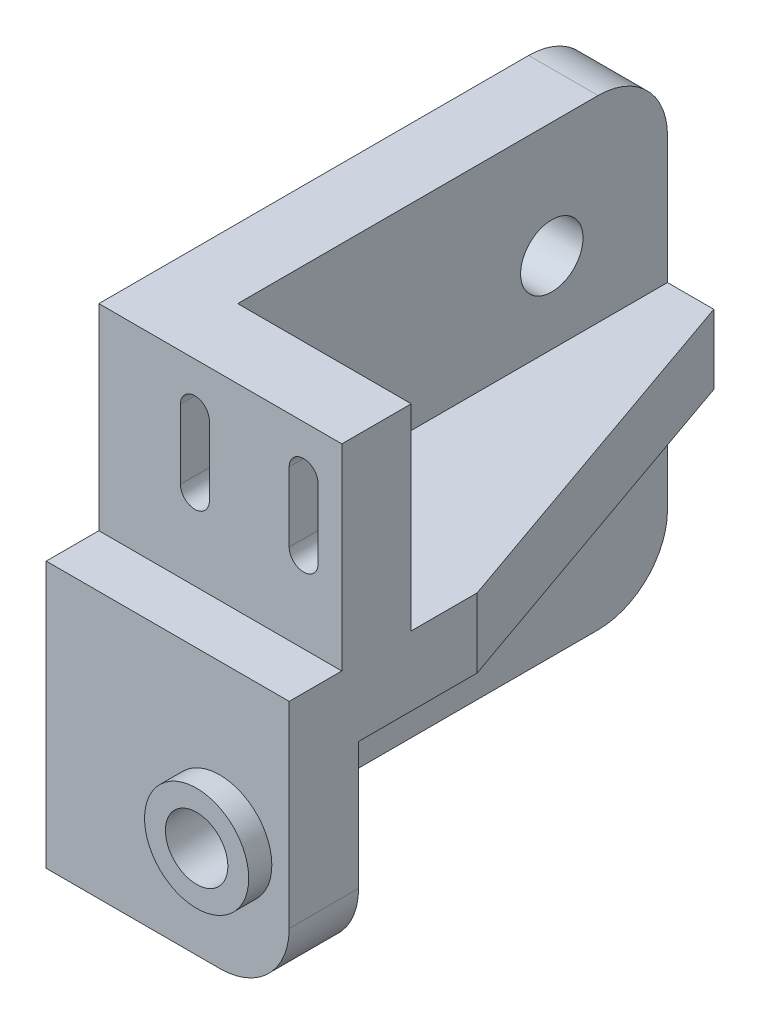
ISO-10303-21;
HEADER;
FILE_DESCRIPTION(('STEP AP214'),'2;1');
FILE_NAME('part.step','',(''),(''),'','','');
FILE_SCHEMA(('AUTOMOTIVE_DESIGN { 1 0 10303 214 1 1 1 1 }'));
ENDSEC;
DATA;
#1=APPLICATION_CONTEXT('core data for automotive mechanical design processes');
#2=APPLICATION_PROTOCOL_DEFINITION('international standard','automotive_design',2000,#1);
#3=PRODUCT_CONTEXT('',#1,'mechanical');
#4=PRODUCT('Part','Part','',(#3));
#5=PRODUCT_RELATED_PRODUCT_CATEGORY('part','',(#4));
#6=PRODUCT_DEFINITION_FORMATION('','',#4);
#7=PRODUCT_DEFINITION_CONTEXT('part definition',#1,'design');
#8=PRODUCT_DEFINITION('design','',#6,#7);
#9=PRODUCT_DEFINITION_SHAPE('','',#8);
#10=(LENGTH_UNIT() NAMED_UNIT(*) SI_UNIT(.MILLI.,.METRE.));
#11=(NAMED_UNIT(*) PLANE_ANGLE_UNIT() SI_UNIT($,.RADIAN.));
#12=(NAMED_UNIT(*) SI_UNIT($,.STERADIAN.) SOLID_ANGLE_UNIT());
#13=UNCERTAINTY_MEASURE_WITH_UNIT(LENGTH_MEASURE(1.E-05),#10,'distance_accuracy_value','');
#14=(GEOMETRIC_REPRESENTATION_CONTEXT(3) GLOBAL_UNCERTAINTY_ASSIGNED_CONTEXT((#13)) GLOBAL_UNIT_ASSIGNED_CONTEXT((#10,
#11,#12)) REPRESENTATION_CONTEXT('',''));
#15=CARTESIAN_POINT('',(0.,0.,0.));
#16=DIRECTION('',(0.,0.,1.));
#17=DIRECTION('',(1.,0.,0.));
#18=AXIS2_PLACEMENT_3D('',#15,#16,#17);
#19=CARTESIAN_POINT('',(6.,0.,0.));
#20=DIRECTION('',(0.,0.,1.));
#21=DIRECTION('',(1.,0.,0.));
#22=AXIS2_PLACEMENT_3D('',#19,#20,#21);
#23=PLANE('',#22);
#24=CARTESIAN_POINT('',(17.7,36.,0.));
#25=DIRECTION('',(0.,0.,1.));
#26=DIRECTION('',(1.,0.,0.));
#27=AXIS2_PLACEMENT_3D('',#24,#25,#26);
#28=CIRCLE('',#27,1.25);
#29=CARTESIAN_POINT('',(18.95,36.,0.));
#30=VERTEX_POINT('',#29);
#31=CARTESIAN_POINT('',(16.45,36.,0.));
#32=VERTEX_POINT('',#31);
#33=EDGE_CURVE('E228',#30,#32,#28,.T.);
#34=ORIENTED_EDGE('',*,*,#33,.F.);
#35=DIRECTION('',(0.,1.,0.));
#36=VECTOR('',#35,1.);
#37=CARTESIAN_POINT('',(18.95,36.,0.));
#38=LINE('',#37,#36);
#39=CARTESIAN_POINT('',(18.95,30.,0.));
#40=VERTEX_POINT('',#39);
#41=EDGE_CURVE('E232',#40,#30,#38,.T.);
#42=ORIENTED_EDGE('',*,*,#41,.F.);
#43=CARTESIAN_POINT('',(17.7,30.,0.));
#44=DIRECTION('',(0.,0.,1.));
#45=DIRECTION('',(1.,0.,0.));
#46=AXIS2_PLACEMENT_3D('',#43,#44,#45);
#47=CIRCLE('',#46,1.25);
#48=CARTESIAN_POINT('',(16.45,30.,0.));
#49=VERTEX_POINT('',#48);
#50=EDGE_CURVE('E210',#49,#40,#47,.T.);
#51=ORIENTED_EDGE('',*,*,#50,.F.);
#52=DIRECTION('',(0.,-1.,0.));
#53=VECTOR('',#52,1.);
#54=CARTESIAN_POINT('',(16.45,36.,0.));
#55=LINE('',#54,#53);
#56=EDGE_CURVE('E222',#32,#49,#55,.T.);
#57=ORIENTED_EDGE('',*,*,#56,.F.);
#58=EDGE_LOOP('',(#34,#42,#51,#57));
#59=FACE_BOUND('',#58,.T.);
#60=CARTESIAN_POINT('',(8.3,35.9999999999999,0.));
#61=DIRECTION('',(0.,0.,1.));
#62=DIRECTION('',(1.,0.,0.));
#63=AXIS2_PLACEMENT_3D('',#60,#61,#62);
#64=CIRCLE('',#63,1.25);
#65=CARTESIAN_POINT('',(9.55,35.9999999999999,0.));
#66=VERTEX_POINT('',#65);
#67=CARTESIAN_POINT('',(7.05,35.9999999999999,0.));
#68=VERTEX_POINT('',#67);
#69=EDGE_CURVE('E247',#66,#68,#64,.T.);
#70=ORIENTED_EDGE('',*,*,#69,.F.);
#71=DIRECTION('',(0.,1.,0.));
#72=VECTOR('',#71,1.);
#73=CARTESIAN_POINT('',(9.55,35.9999999999999,0.));
#74=LINE('',#73,#72);
#75=CARTESIAN_POINT('',(9.55,29.9999999999999,0.));
#76=VERTEX_POINT('',#75);
#77=EDGE_CURVE('E258',#76,#66,#74,.T.);
#78=ORIENTED_EDGE('',*,*,#77,.F.);
#79=CARTESIAN_POINT('',(8.3,29.9999999999999,0.));
#80=DIRECTION('',(0.,0.,1.));
#81=DIRECTION('',(1.,0.,0.));
#82=AXIS2_PLACEMENT_3D('',#79,#80,#81);
#83=CIRCLE('',#82,1.25);
#84=CARTESIAN_POINT('',(7.05,29.9999999999999,0.));
#85=VERTEX_POINT('',#84);
#86=EDGE_CURVE('E254',#85,#76,#83,.T.);
#87=ORIENTED_EDGE('',*,*,#86,.F.);
#88=DIRECTION('',(0.,-1.,0.));
#89=VECTOR('',#88,1.);
#90=CARTESIAN_POINT('',(7.05,35.9999999999999,0.));
#91=LINE('',#90,#89);
#92=EDGE_CURVE('E250',#68,#85,#91,.T.);
#93=ORIENTED_EDGE('',*,*,#92,.F.);
#94=EDGE_LOOP('',(#70,#78,#87,#93));
#95=FACE_BOUND('',#94,.T.);
#96=DIRECTION('',(0.,1.,0.));
#97=VECTOR('',#96,1.);
#98=CARTESIAN_POINT('',(0.,0.,0.));
#99=LINE('',#98,#97);
#100=CARTESIAN_POINT('',(0.,23.,0.));
#101=VERTEX_POINT('',#100);
#102=CARTESIAN_POINT('',(0.,40.,0.));
#103=VERTEX_POINT('',#102);
#104=EDGE_CURVE('E387',#101,#103,#99,.T.);
#105=ORIENTED_EDGE('',*,*,#104,.F.);
#106=DIRECTION('',(-1.,0.,0.));
#107=VECTOR('',#106,1.);
#108=CARTESIAN_POINT('',(21.,23.,0.));
#109=LINE('',#108,#107);
#110=CARTESIAN_POINT('',(21.,23.,0.));
#111=VERTEX_POINT('',#110);
#112=EDGE_CURVE('E346',#111,#101,#109,.T.);
#113=ORIENTED_EDGE('',*,*,#112,.F.);
#114=DIRECTION('',(0.,-1.,0.));
#115=VECTOR('',#114,1.);
#116=CARTESIAN_POINT('',(21.,40.,0.));
#117=LINE('',#116,#115);
#118=CARTESIAN_POINT('',(21.,40.,0.));
#119=VERTEX_POINT('',#118);
#120=EDGE_CURVE('E331',#119,#111,#117,.T.);
#121=ORIENTED_EDGE('',*,*,#120,.F.);
#122=DIRECTION('',(-1.,0.,0.));
#123=VECTOR('',#122,1.);
#124=CARTESIAN_POINT('',(6.,40.,0.));
#125=LINE('',#124,#123);
#126=EDGE_CURVE('E400',#119,#103,#125,.T.);
#127=ORIENTED_EDGE('',*,*,#126,.T.);
#128=EDGE_LOOP('',(#105,#113,#121,#127));
#129=FACE_BOUND('',#128,.T.);
#130=ADVANCED_FACE('F41',(#59,#95,#129),#23,.T.);
#131=CARTESIAN_POINT('',(6.,0.,0.));
#132=DIRECTION('',(-1.,0.,0.));
#133=DIRECTION('',(0.,0.,1.));
#134=AXIS2_PLACEMENT_3D('',#131,#132,#133);
#135=PLANE('',#134);
#136=CARTESIAN_POINT('',(6.,10.,-33.15));
#137=DIRECTION('',(-1.,0.,0.));
#138=DIRECTION('',(0.,0.,1.));
#139=AXIS2_PLACEMENT_3D('',#136,#137,#138);
#140=CIRCLE('',#139,2.7);
#141=CARTESIAN_POINT('',(6.,10.,-30.45));
#142=VERTEX_POINT('',#141);
#143=EDGE_CURVE('E304',#142,#142,#140,.T.);
#144=ORIENTED_EDGE('',*,*,#143,.T.);
#145=EDGE_LOOP('',(#144));
#146=FACE_BOUND('',#145,.T.);
#147=DIRECTION('',(0.,0.,-1.));
#148=VECTOR('',#147,1.);
#149=CARTESIAN_POINT('',(6.,0.,0.));
#150=LINE('',#149,#148);
#151=CARTESIAN_POINT('',(6.,0.,-1.45));
#152=VERTEX_POINT('',#151);
#153=CARTESIAN_POINT('',(6.,0.,-37.15));
#154=VERTEX_POINT('',#153);
#155=EDGE_CURVE('E397',#152,#154,#150,.T.);
#156=ORIENTED_EDGE('',*,*,#155,.T.);
#157=CARTESIAN_POINT('',(6.,6.,-37.15));
#158=DIRECTION('',(-1.,0.,0.));
#159=DIRECTION('',(0.,0.,1.));
#160=AXIS2_PLACEMENT_3D('',#157,#158,#159);
#161=CIRCLE('',#160,6.);
#162=CARTESIAN_POINT('',(6.,6.,-43.15));
#163=VERTEX_POINT('',#162);
#164=EDGE_CURVE('E11',#154,#163,#161,.F.);
#165=ORIENTED_EDGE('',*,*,#164,.T.);
#166=DIRECTION('',(0.,1.,0.));
#167=VECTOR('',#166,1.);
#168=CARTESIAN_POINT('',(6.,0.,-43.15));
#169=LINE('',#168,#167);
#170=CARTESIAN_POINT('',(6.,17.,-43.15));
#171=VERTEX_POINT('',#170);
#172=EDGE_CURVE('E394',#163,#171,#169,.T.);
#173=ORIENTED_EDGE('',*,*,#172,.T.);
#174=DIRECTION('',(0.,0.,-1.));
#175=VECTOR('',#174,1.);
#176=CARTESIAN_POINT('',(6.,17.,0.));
#177=LINE('',#176,#175);
#178=CARTESIAN_POINT('',(6.,17.,-1.45));
#179=VERTEX_POINT('',#178);
#180=EDGE_CURVE('E380',#179,#171,#177,.T.);
#181=ORIENTED_EDGE('',*,*,#180,.F.);
#182=DIRECTION('',(0.,1.,0.));
#183=VECTOR('',#182,1.);
#184=CARTESIAN_POINT('',(6.,0.,-1.45));
#185=LINE('',#184,#183);
#186=EDGE_CURVE('E384',#152,#179,#185,.T.);
#187=ORIENTED_EDGE('',*,*,#186,.F.);
#188=EDGE_LOOP('',(#156,#165,#173,#181,#187));
#189=FACE_BOUND('',#188,.T.);
#190=ADVANCED_FACE('F539',(#146,#189),#135,.F.);
#191=CARTESIAN_POINT('',(6.,30.,-33.15));
#192=DIRECTION('',(-1.,0.,0.));
#193=DIRECTION('',(0.,0.,1.));
#194=AXIS2_PLACEMENT_3D('',#191,#192,#193);
#195=CIRCLE('',#194,2.69999999999999);
#196=CARTESIAN_POINT('',(6.,30.,-30.45));
#197=VERTEX_POINT('',#196);
#198=EDGE_CURVE('E296',#197,#197,#195,.T.);
#199=ORIENTED_EDGE('',*,*,#198,.T.);
#200=EDGE_LOOP('',(#199));
#201=FACE_BOUND('',#200,.T.);
#202=CARTESIAN_POINT('',(6.,23.,-43.15));
#203=VERTEX_POINT('',#202);
#204=CARTESIAN_POINT('',(6.,34.,-43.15));
#205=VERTEX_POINT('',#204);
#206=EDGE_CURVE('E392',#203,#205,#169,.T.);
#207=ORIENTED_EDGE('',*,*,#206,.T.);
#208=CARTESIAN_POINT('',(6.,34.,-37.15));
#209=DIRECTION('',(-1.,0.,0.));
#210=DIRECTION('',(0.,0.,1.));
#211=AXIS2_PLACEMENT_3D('',#208,#209,#210);
#212=CIRCLE('',#211,6.);
#213=CARTESIAN_POINT('',(6.,40.,-37.15));
#214=VERTEX_POINT('',#213);
#215=EDGE_CURVE('E484',#205,#214,#212,.F.);
#216=ORIENTED_EDGE('',*,*,#215,.T.);
#217=DIRECTION('',(0.,0.,-1.));
#218=VECTOR('',#217,1.);
#219=CARTESIAN_POINT('',(6.,40.,0.));
#220=LINE('',#219,#218);
#221=CARTESIAN_POINT('',(6.,40.,-6.));
#222=VERTEX_POINT('',#221);
#223=EDGE_CURVE('E388',#222,#214,#220,.T.);
#224=ORIENTED_EDGE('',*,*,#223,.F.);
#225=DIRECTION('',(0.,1.,0.));
#226=VECTOR('',#225,1.);
#227=CARTESIAN_POINT('',(6.,0.,-6.));
#228=LINE('',#227,#226);
#229=CARTESIAN_POINT('',(6.,23.,-6.));
#230=VERTEX_POINT('',#229);
#231=EDGE_CURVE('E374',#230,#222,#228,.T.);
#232=ORIENTED_EDGE('',*,*,#231,.F.);
#233=DIRECTION('',(0.,0.,1.));
#234=VECTOR('',#233,1.);
#235=CARTESIAN_POINT('',(6.,23.,0.));
#236=LINE('',#235,#234);
#237=EDGE_CURVE('E377',#203,#230,#236,.T.);
#238=ORIENTED_EDGE('',*,*,#237,.F.);
#239=EDGE_LOOP('',(#207,#216,#224,#232,#238));
#240=FACE_BOUND('',#239,.T.);
#241=ADVANCED_FACE('F491',(#201,#240),#135,.F.);
#242=CARTESIAN_POINT('',(6.,0.,0.));
#243=DIRECTION('',(0.,1.,0.));
#244=DIRECTION('',(0.,0.,1.));
#245=AXIS2_PLACEMENT_3D('',#242,#243,#244);
#246=PLANE('',#245);
#247=DIRECTION('',(0.,0.,-1.));
#248=VECTOR('',#247,1.);
#249=CARTESIAN_POINT('',(0.,0.,0.));
#250=LINE('',#249,#248);
#251=CARTESIAN_POINT('',(0.,0.,4.55));
#252=VERTEX_POINT('',#251);
#253=CARTESIAN_POINT('',(0.,0.,-37.15));
#254=VERTEX_POINT('',#253);
#255=EDGE_CURVE('E393',#252,#254,#250,.T.);
#256=ORIENTED_EDGE('',*,*,#255,.T.);
#257=DIRECTION('',(-1.,0.,0.));
#258=VECTOR('',#257,1.);
#259=CARTESIAN_POINT('',(6.,0.,-37.15));
#260=LINE('',#259,#258);
#261=EDGE_CURVE('E50',#254,#154,#260,.F.);
#262=ORIENTED_EDGE('',*,*,#261,.T.);
#263=ORIENTED_EDGE('',*,*,#155,.F.);
#264=DIRECTION('',(-1.,0.,0.));
#265=VECTOR('',#264,1.);
#266=CARTESIAN_POINT('',(21.,0.,-1.45));
#267=LINE('',#266,#265);
#268=CARTESIAN_POINT('',(15.,0.,-1.45));
#269=VERTEX_POINT('',#268);
#270=EDGE_CURVE('E368',#269,#152,#267,.T.);
#271=ORIENTED_EDGE('',*,*,#270,.F.);
#272=DIRECTION('',(0.,0.,-1.));
#273=VECTOR('',#272,1.);
#274=CARTESIAN_POINT('',(15.,0.,4.55));
#275=LINE('',#274,#273);
#276=CARTESIAN_POINT('',(15.,0.,4.55));
#277=VERTEX_POINT('',#276);
#278=EDGE_CURVE('E462',#269,#277,#275,.F.);
#279=ORIENTED_EDGE('',*,*,#278,.T.);
#280=DIRECTION('',(-1.,0.,0.));
#281=VECTOR('',#280,1.);
#282=CARTESIAN_POINT('',(21.,0.,4.55));
#283=LINE('',#282,#281);
#284=EDGE_CURVE('E371',#277,#252,#283,.T.);
#285=ORIENTED_EDGE('',*,*,#284,.T.);
#286=EDGE_LOOP('',(#256,#262,#263,#271,#279,#285));
#287=FACE_BOUND('',#286,.T.);
#288=ADVANCED_FACE('F545',(#287),#246,.F.);
#289=CARTESIAN_POINT('',(6.,0.,-43.15));
#290=DIRECTION('',(0.,0.,1.));
#291=DIRECTION('',(1.,0.,0.));
#292=AXIS2_PLACEMENT_3D('',#289,#290,#291);
#293=PLANE('',#292);
#294=DIRECTION('',(0.,1.,0.));
#295=VECTOR('',#294,1.);
#296=CARTESIAN_POINT('',(0.,0.,-43.15));
#297=LINE('',#296,#295);
#298=CARTESIAN_POINT('',(0.,6.,-43.15));
#299=VERTEX_POINT('',#298);
#300=CARTESIAN_POINT('',(0.,34.,-43.15));
#301=VERTEX_POINT('',#300);
#302=EDGE_CURVE('E407',#299,#301,#297,.T.);
#303=ORIENTED_EDGE('',*,*,#302,.T.);
#304=DIRECTION('',(-1.,0.,0.));
#305=VECTOR('',#304,1.);
#306=CARTESIAN_POINT('',(6.,34.,-43.15));
#307=LINE('',#306,#305);
#308=EDGE_CURVE('E64',#301,#205,#307,.F.);
#309=ORIENTED_EDGE('',*,*,#308,.T.);
#310=ORIENTED_EDGE('',*,*,#206,.F.);
#311=DIRECTION('',(-1.,0.,0.));
#312=VECTOR('',#311,1.);
#313=CARTESIAN_POINT('',(21.,23.,-43.15));
#314=LINE('',#313,#312);
#315=CARTESIAN_POINT('',(9.99999999999999,23.,-43.15));
#316=VERTEX_POINT('',#315);
#317=EDGE_CURVE('E357',#316,#203,#314,.T.);
#318=ORIENTED_EDGE('',*,*,#317,.F.);
#319=DIRECTION('',(0.,-1.,0.));
#320=VECTOR('',#319,1.);
#321=CARTESIAN_POINT('',(9.99999999999999,17.,-43.15));
#322=LINE('',#321,#320);
#323=CARTESIAN_POINT('',(9.99999999999999,17.,-43.15));
#324=VERTEX_POINT('',#323);
#325=EDGE_CURVE('E422',#316,#324,#322,.T.);
#326=ORIENTED_EDGE('',*,*,#325,.T.);
#327=DIRECTION('',(-1.,0.,0.));
#328=VECTOR('',#327,1.);
#329=CARTESIAN_POINT('',(21.,17.,-43.15));
#330=LINE('',#329,#328);
#331=EDGE_CURVE('E360',#324,#171,#330,.T.);
#332=ORIENTED_EDGE('',*,*,#331,.T.);
#333=ORIENTED_EDGE('',*,*,#172,.F.);
#334=DIRECTION('',(-1.,0.,0.));
#335=VECTOR('',#334,1.);
#336=CARTESIAN_POINT('',(6.,6.,-43.15));
#337=LINE('',#336,#335);
#338=EDGE_CURVE('E478',#163,#299,#337,.T.);
#339=ORIENTED_EDGE('',*,*,#338,.T.);
#340=EDGE_LOOP('',(#303,#309,#310,#318,#326,#332,#333,#339));
#341=FACE_BOUND('',#340,.T.);
#342=ADVANCED_FACE('F522',(#341),#293,.F.);
#343=CARTESIAN_POINT('',(6.,40.,0.));
#344=DIRECTION('',(0.,1.,0.));
#345=DIRECTION('',(0.,0.,1.));
#346=AXIS2_PLACEMENT_3D('',#343,#344,#345);
#347=PLANE('',#346);
#348=ORIENTED_EDGE('',*,*,#223,.T.);
#349=DIRECTION('',(-1.,0.,0.));
#350=VECTOR('',#349,1.);
#351=CARTESIAN_POINT('',(0.,40.,-37.15));
#352=LINE('',#351,#350);
#353=CARTESIAN_POINT('',(0.,40.,-37.15));
#354=VERTEX_POINT('',#353);
#355=EDGE_CURVE('E468',#214,#354,#352,.T.);
#356=ORIENTED_EDGE('',*,*,#355,.T.);
#357=DIRECTION('',(0.,0.,-1.));
#358=VECTOR('',#357,1.);
#359=CARTESIAN_POINT('',(0.,40.,0.));
#360=LINE('',#359,#358);
#361=EDGE_CURVE('E403',#103,#354,#360,.T.);
#362=ORIENTED_EDGE('',*,*,#361,.F.);
#363=ORIENTED_EDGE('',*,*,#126,.F.);
#364=DIRECTION('',(0.,0.,1.));
#365=VECTOR('',#364,1.);
#366=CARTESIAN_POINT('',(21.,40.,0.));
#367=LINE('',#366,#365);
#368=CARTESIAN_POINT('',(21.,40.,-6.));
#369=VERTEX_POINT('',#368);
#370=EDGE_CURVE('E327',#369,#119,#367,.T.);
#371=ORIENTED_EDGE('',*,*,#370,.F.);
#372=DIRECTION('',(-1.,0.,0.));
#373=VECTOR('',#372,1.);
#374=CARTESIAN_POINT('',(21.,40.,-6.));
#375=LINE('',#374,#373);
#376=EDGE_CURVE('E349',#369,#222,#375,.T.);
#377=ORIENTED_EDGE('',*,*,#376,.T.);
#378=EDGE_LOOP('',(#348,#356,#362,#363,#371,#377));
#379=FACE_BOUND('',#378,.T.);
#380=ADVANCED_FACE('F500',(#379),#347,.T.);
#381=CARTESIAN_POINT('',(0.,0.,0.));
#382=DIRECTION('',(-1.,0.,0.));
#383=DIRECTION('',(0.,0.,1.));
#384=AXIS2_PLACEMENT_3D('',#381,#382,#383);
#385=PLANE('',#384);
#386=CARTESIAN_POINT('',(0.,30.,-33.15));
#387=DIRECTION('',(-1.,0.,0.));
#388=DIRECTION('',(0.,0.,1.));
#389=AXIS2_PLACEMENT_3D('',#386,#387,#388);
#390=CIRCLE('',#389,2.69999999999999);
#391=CARTESIAN_POINT('',(0.,30.,-30.45));
#392=VERTEX_POINT('',#391);
#393=EDGE_CURVE('E286',#392,#392,#390,.T.);
#394=ORIENTED_EDGE('',*,*,#393,.F.);
#395=EDGE_LOOP('',(#394));
#396=FACE_BOUND('',#395,.T.);
#397=CARTESIAN_POINT('',(0.,10.,-33.15));
#398=DIRECTION('',(-1.,0.,0.));
#399=DIRECTION('',(0.,0.,1.));
#400=AXIS2_PLACEMENT_3D('',#397,#398,#399);
#401=CIRCLE('',#400,2.7);
#402=CARTESIAN_POINT('',(0.,10.,-30.45));
#403=VERTEX_POINT('',#402);
#404=EDGE_CURVE('E300',#403,#403,#401,.T.);
#405=ORIENTED_EDGE('',*,*,#404,.F.);
#406=EDGE_LOOP('',(#405));
#407=FACE_BOUND('',#406,.T.);
#408=ORIENTED_EDGE('',*,*,#361,.T.);
#409=CARTESIAN_POINT('',(0.,34.,-37.15));
#410=DIRECTION('',(-1.,0.,0.));
#411=DIRECTION('',(0.,0.,1.));
#412=AXIS2_PLACEMENT_3D('',#409,#410,#411);
#413=CIRCLE('',#412,6.);
#414=EDGE_CURVE('E475',#354,#301,#413,.T.);
#415=ORIENTED_EDGE('',*,*,#414,.T.);
#416=ORIENTED_EDGE('',*,*,#302,.F.);
#417=CARTESIAN_POINT('',(0.,6.,-37.15));
#418=DIRECTION('',(-1.,0.,0.));
#419=DIRECTION('',(0.,0.,1.));
#420=AXIS2_PLACEMENT_3D('',#417,#418,#419);
#421=CIRCLE('',#420,6.);
#422=EDGE_CURVE('E472',#299,#254,#421,.T.);
#423=ORIENTED_EDGE('',*,*,#422,.T.);
#424=ORIENTED_EDGE('',*,*,#255,.F.);
#425=DIRECTION('',(0.,-1.,0.));
#426=VECTOR('',#425,1.);
#427=CARTESIAN_POINT('',(0.,23.,4.55));
#428=LINE('',#427,#426);
#429=CARTESIAN_POINT('',(0.,23.,4.55));
#430=VERTEX_POINT('',#429);
#431=EDGE_CURVE('E308',#430,#252,#428,.T.);
#432=ORIENTED_EDGE('',*,*,#431,.F.);
#433=DIRECTION('',(0.,0.,1.));
#434=VECTOR('',#433,1.);
#435=CARTESIAN_POINT('',(0.,23.,4.55));
#436=LINE('',#435,#434);
#437=EDGE_CURVE('E314',#101,#430,#436,.T.);
#438=ORIENTED_EDGE('',*,*,#437,.F.);
#439=ORIENTED_EDGE('',*,*,#104,.T.);
#440=EDGE_LOOP('',(#408,#415,#416,#423,#424,#432,#438,#439));
#441=FACE_BOUND('',#440,.T.);
#442=ADVANCED_FACE('F502',(#396,#407,#441),#385,.T.);
#443=CARTESIAN_POINT('',(21.,17.,-1.45));
#444=DIRECTION('',(0.,0.,1.));
#445=DIRECTION('',(0.,-1.,0.));
#446=AXIS2_PLACEMENT_3D('',#443,#444,#445);
#447=PLANE('',#446);
#448=CARTESIAN_POINT('',(15.,10.,-1.45));
#449=DIRECTION('',(0.,0.,1.));
#450=DIRECTION('',(0.,-1.,0.));
#451=AXIS2_PLACEMENT_3D('',#448,#449,#450);
#452=CIRCLE('',#451,2.69999999999999);
#453=CARTESIAN_POINT('',(15.,7.30000000000001,-1.45));
#454=VERTEX_POINT('',#453);
#455=EDGE_CURVE('E278',#454,#454,#452,.T.);
#456=ORIENTED_EDGE('',*,*,#455,.T.);
#457=EDGE_LOOP('',(#456));
#458=FACE_BOUND('',#457,.T.);
#459=DIRECTION('',(0.,1.,0.));
#460=VECTOR('',#459,1.);
#461=CARTESIAN_POINT('',(21.,17.,-1.45));
#462=LINE('',#461,#460);
#463=CARTESIAN_POINT('',(21.,6.,-1.45));
#464=VERTEX_POINT('',#463);
#465=CARTESIAN_POINT('',(21.,17.,-1.45));
#466=VERTEX_POINT('',#465);
#467=EDGE_CURVE('E313',#464,#466,#462,.T.);
#468=ORIENTED_EDGE('',*,*,#467,.F.);
#469=CARTESIAN_POINT('',(15.,6.,-1.45));
#470=DIRECTION('',(0.,0.,1.));
#471=DIRECTION('',(0.,-1.,0.));
#472=AXIS2_PLACEMENT_3D('',#469,#470,#471);
#473=CIRCLE('',#472,6.);
#474=EDGE_CURVE('E459',#464,#269,#473,.F.);
#475=ORIENTED_EDGE('',*,*,#474,.T.);
#476=ORIENTED_EDGE('',*,*,#270,.T.);
#477=ORIENTED_EDGE('',*,*,#186,.T.);
#478=DIRECTION('',(-1.,0.,0.));
#479=VECTOR('',#478,1.);
#480=CARTESIAN_POINT('',(21.,17.,-1.45));
#481=LINE('',#480,#479);
#482=EDGE_CURVE('E364',#466,#179,#481,.T.);
#483=ORIENTED_EDGE('',*,*,#482,.F.);
#484=EDGE_LOOP('',(#468,#475,#476,#477,#483));
#485=FACE_BOUND('',#484,.T.);
#486=ADVANCED_FACE('F535',(#458,#485),#447,.F.);
#487=CARTESIAN_POINT('',(21.,17.,-1.45));
#488=DIRECTION('',(0.,1.,0.));
#489=DIRECTION('',(0.,0.,1.));
#490=AXIS2_PLACEMENT_3D('',#487,#488,#489);
#491=PLANE('',#490);
#492=ORIENTED_EDGE('',*,*,#331,.F.);
#493=DIRECTION('',(0.330149880798441,0.,0.943928522828278));
#494=VECTOR('',#493,1.);
#495=CARTESIAN_POINT('',(21.,17.,-11.6999999999997));
#496=LINE('',#495,#494);
#497=CARTESIAN_POINT('',(21.,17.,-11.6999999999997));
#498=VERTEX_POINT('',#497);
#499=EDGE_CURVE('E292',#324,#498,#496,.T.);
#500=ORIENTED_EDGE('',*,*,#499,.T.);
#501=DIRECTION('',(0.,0.,-1.));
#502=VECTOR('',#501,1.);
#503=CARTESIAN_POINT('',(21.,17.,-1.45));
#504=LINE('',#503,#502);
#505=EDGE_CURVE('E317',#466,#498,#504,.T.);
#506=ORIENTED_EDGE('',*,*,#505,.F.);
#507=ORIENTED_EDGE('',*,*,#482,.T.);
#508=ORIENTED_EDGE('',*,*,#180,.T.);
#509=EDGE_LOOP('',(#492,#500,#506,#507,#508));
#510=FACE_BOUND('',#509,.T.);
#511=ADVANCED_FACE('F530',(#510),#491,.F.);
#512=CARTESIAN_POINT('',(21.,23.,-6.));
#513=DIRECTION('',(0.,-1.,0.));
#514=DIRECTION('',(0.,0.,-1.));
#515=AXIS2_PLACEMENT_3D('',#512,#513,#514);
#516=PLANE('',#515);
#517=DIRECTION('',(0.,0.,1.));
#518=VECTOR('',#517,1.);
#519=CARTESIAN_POINT('',(21.,23.,-6.));
#520=LINE('',#519,#518);
#521=CARTESIAN_POINT('',(21.,23.,-11.6999999999997));
#522=VERTEX_POINT('',#521);
#523=CARTESIAN_POINT('',(21.,23.,-6.));
#524=VERTEX_POINT('',#523);
#525=EDGE_CURVE('E321',#522,#524,#520,.T.);
#526=ORIENTED_EDGE('',*,*,#525,.F.);
#527=DIRECTION('',(-0.330149880798441,0.,-0.943928522828278));
#528=VECTOR('',#527,1.);
#529=CARTESIAN_POINT('',(21.,23.,-11.6999999999997));
#530=LINE('',#529,#528);
#531=EDGE_CURVE('E419',#522,#316,#530,.T.);
#532=ORIENTED_EDGE('',*,*,#531,.T.);
#533=ORIENTED_EDGE('',*,*,#317,.T.);
#534=ORIENTED_EDGE('',*,*,#237,.T.);
#535=DIRECTION('',(-1.,0.,0.));
#536=VECTOR('',#535,1.);
#537=CARTESIAN_POINT('',(21.,23.,-6.));
#538=LINE('',#537,#536);
#539=EDGE_CURVE('E353',#524,#230,#538,.T.);
#540=ORIENTED_EDGE('',*,*,#539,.F.);
#541=EDGE_LOOP('',(#526,#532,#533,#534,#540));
#542=FACE_BOUND('',#541,.T.);
#543=ADVANCED_FACE('F520',(#542),#516,.F.);
#544=CARTESIAN_POINT('',(21.,40.,-6.));
#545=DIRECTION('',(0.,0.,1.));
#546=DIRECTION('',(0.,-1.,0.));
#547=AXIS2_PLACEMENT_3D('',#544,#545,#546);
#548=PLANE('',#547);
#549=DIRECTION('',(0.,1.,0.));
#550=VECTOR('',#549,1.);
#551=CARTESIAN_POINT('',(18.95,40.,-6.));
#552=LINE('',#551,#550);
#553=CARTESIAN_POINT('',(18.95,30.,-6.00000000000002));
#554=VERTEX_POINT('',#553);
#555=CARTESIAN_POINT('',(18.95,36.,-6.00000000000001));
#556=VERTEX_POINT('',#555);
#557=EDGE_CURVE('E447',#554,#556,#552,.T.);
#558=ORIENTED_EDGE('',*,*,#557,.T.);
#559=CARTESIAN_POINT('',(17.7,36.,-6.00000000000001));
#560=DIRECTION('',(0.,0.,1.));
#561=DIRECTION('',(0.,-1.,0.));
#562=AXIS2_PLACEMENT_3D('',#559,#560,#561);
#563=CIRCLE('',#562,1.25);
#564=CARTESIAN_POINT('',(16.45,36.,-6.00000000000001));
#565=VERTEX_POINT('',#564);
#566=EDGE_CURVE('E451',#556,#565,#563,.T.);
#567=ORIENTED_EDGE('',*,*,#566,.T.);
#568=DIRECTION('',(0.,-1.,0.));
#569=VECTOR('',#568,1.);
#570=CARTESIAN_POINT('',(16.45,40.,-6.));
#571=LINE('',#570,#569);
#572=CARTESIAN_POINT('',(16.45,30.,-6.));
#573=VERTEX_POINT('',#572);
#574=EDGE_CURVE('E442',#565,#573,#571,.T.);
#575=ORIENTED_EDGE('',*,*,#574,.T.);
#576=CARTESIAN_POINT('',(17.7,30.,-6.00000000000001));
#577=DIRECTION('',(0.,0.,1.));
#578=DIRECTION('',(0.,-1.,0.));
#579=AXIS2_PLACEMENT_3D('',#576,#577,#578);
#580=CIRCLE('',#579,1.25);
#581=EDGE_CURVE('E213',#573,#554,#580,.T.);
#582=ORIENTED_EDGE('',*,*,#581,.T.);
#583=EDGE_LOOP('',(#558,#567,#575,#582));
#584=FACE_BOUND('',#583,.T.);
#585=DIRECTION('',(0.,1.,0.));
#586=VECTOR('',#585,1.);
#587=CARTESIAN_POINT('',(9.55,40.,-6.));
#588=LINE('',#587,#586);
#589=CARTESIAN_POINT('',(9.55,29.9999999999999,-6.00000000000002));
#590=VERTEX_POINT('',#589);
#591=CARTESIAN_POINT('',(9.55,35.9999999999999,-6.00000000000001));
#592=VERTEX_POINT('',#591);
#593=EDGE_CURVE('E434',#590,#592,#588,.T.);
#594=ORIENTED_EDGE('',*,*,#593,.T.);
#595=CARTESIAN_POINT('',(8.3,35.9999999999999,-6.00000000000001));
#596=DIRECTION('',(0.,0.,1.));
#597=DIRECTION('',(0.,-1.,0.));
#598=AXIS2_PLACEMENT_3D('',#595,#596,#597);
#599=CIRCLE('',#598,1.25);
#600=CARTESIAN_POINT('',(7.05,35.9999999999999,-6.00000000000001));
#601=VERTEX_POINT('',#600);
#602=EDGE_CURVE('E438',#592,#601,#599,.T.);
#603=ORIENTED_EDGE('',*,*,#602,.T.);
#604=DIRECTION('',(0.,-1.,0.));
#605=VECTOR('',#604,1.);
#606=CARTESIAN_POINT('',(7.05,40.,-6.));
#607=LINE('',#606,#605);
#608=CARTESIAN_POINT('',(7.04999999999999,29.9999999999999,-6.));
#609=VERTEX_POINT('',#608);
#610=EDGE_CURVE('E291',#601,#609,#607,.T.);
#611=ORIENTED_EDGE('',*,*,#610,.T.);
#612=CARTESIAN_POINT('',(8.3,29.9999999999999,-6.00000000000001));
#613=DIRECTION('',(0.,0.,1.));
#614=DIRECTION('',(0.,-1.,0.));
#615=AXIS2_PLACEMENT_3D('',#612,#613,#614);
#616=CIRCLE('',#615,1.25);
#617=EDGE_CURVE('E430',#609,#590,#616,.T.);
#618=ORIENTED_EDGE('',*,*,#617,.T.);
#619=EDGE_LOOP('',(#594,#603,#611,#618));
#620=FACE_BOUND('',#619,.T.);
#621=ORIENTED_EDGE('',*,*,#539,.T.);
#622=ORIENTED_EDGE('',*,*,#231,.T.);
#623=ORIENTED_EDGE('',*,*,#376,.F.);
#624=DIRECTION('',(0.,1.,0.));
#625=VECTOR('',#624,1.);
#626=CARTESIAN_POINT('',(21.,40.,-6.));
#627=LINE('',#626,#625);
#628=EDGE_CURVE('E324',#524,#369,#627,.T.);
#629=ORIENTED_EDGE('',*,*,#628,.F.);
#630=EDGE_LOOP('',(#621,#622,#623,#629));
#631=FACE_BOUND('',#630,.T.);
#632=ADVANCED_FACE('F518',(#584,#620,#631),#548,.F.);
#633=CARTESIAN_POINT('',(21.,23.,4.55));
#634=DIRECTION('',(0.,0.,-1.));
#635=DIRECTION('',(0.,1.,0.));
#636=AXIS2_PLACEMENT_3D('',#633,#634,#635);
#637=PLANE('',#636);
#638=CARTESIAN_POINT('',(15.,10.,4.55));
#639=DIRECTION('',(0.,0.,1.));
#640=DIRECTION('',(1.,0.,0.));
#641=AXIS2_PLACEMENT_3D('',#638,#639,#640);
#642=CIRCLE('',#641,4.5);
#643=CARTESIAN_POINT('',(19.5,10.,4.55));
#644=VERTEX_POINT('',#643);
#645=EDGE_CURVE('E287',#644,#644,#642,.T.);
#646=ORIENTED_EDGE('',*,*,#645,.F.);
#647=EDGE_LOOP('',(#646));
#648=FACE_BOUND('',#647,.T.);
#649=ORIENTED_EDGE('',*,*,#284,.F.);
#650=CARTESIAN_POINT('',(15.,6.,4.55));
#651=DIRECTION('',(0.,0.,-1.));
#652=DIRECTION('',(0.,1.,0.));
#653=AXIS2_PLACEMENT_3D('',#650,#651,#652);
#654=CIRCLE('',#653,6.);
#655=CARTESIAN_POINT('',(21.,6.,4.55));
#656=VERTEX_POINT('',#655);
#657=EDGE_CURVE('E465',#277,#656,#654,.F.);
#658=ORIENTED_EDGE('',*,*,#657,.T.);
#659=DIRECTION('',(0.,-1.,0.));
#660=VECTOR('',#659,1.);
#661=CARTESIAN_POINT('',(21.,23.,4.55));
#662=LINE('',#661,#660);
#663=CARTESIAN_POINT('',(21.,23.,4.55));
#664=VERTEX_POINT('',#663);
#665=EDGE_CURVE('E309',#664,#656,#662,.T.);
#666=ORIENTED_EDGE('',*,*,#665,.F.);
#667=DIRECTION('',(-1.,0.,0.));
#668=VECTOR('',#667,1.);
#669=CARTESIAN_POINT('',(21.,23.,4.55));
#670=LINE('',#669,#668);
#671=EDGE_CURVE('E337',#664,#430,#670,.T.);
#672=ORIENTED_EDGE('',*,*,#671,.T.);
#673=ORIENTED_EDGE('',*,*,#431,.T.);
#674=EDGE_LOOP('',(#649,#658,#666,#672,#673));
#675=FACE_BOUND('',#674,.T.);
#676=ADVANCED_FACE('F551',(#648,#675),#637,.F.);
#677=CARTESIAN_POINT('',(21.,23.,4.55));
#678=DIRECTION('',(0.,-1.,0.));
#679=DIRECTION('',(0.,0.,-1.));
#680=AXIS2_PLACEMENT_3D('',#677,#678,#679);
#681=PLANE('',#680);
#682=ORIENTED_EDGE('',*,*,#437,.T.);
#683=ORIENTED_EDGE('',*,*,#671,.F.);
#684=DIRECTION('',(0.,0.,1.));
#685=VECTOR('',#684,1.);
#686=CARTESIAN_POINT('',(21.,23.,4.55));
#687=LINE('',#686,#685);
#688=EDGE_CURVE('E334',#111,#664,#687,.T.);
#689=ORIENTED_EDGE('',*,*,#688,.F.);
#690=ORIENTED_EDGE('',*,*,#112,.T.);
#691=EDGE_LOOP('',(#682,#683,#689,#690));
#692=FACE_BOUND('',#691,.T.);
#693=ADVANCED_FACE('F584',(#692),#681,.F.);
#694=CARTESIAN_POINT('',(21.,0.,0.));
#695=DIRECTION('',(1.,0.,0.));
#696=DIRECTION('',(0.,0.,-1.));
#697=AXIS2_PLACEMENT_3D('',#694,#695,#696);
#698=PLANE('',#697);
#699=ORIENTED_EDGE('',*,*,#665,.T.);
#700=DIRECTION('',(0.,0.,-1.));
#701=VECTOR('',#700,1.);
#702=CARTESIAN_POINT('',(21.,6.,-1.45));
#703=LINE('',#702,#701);
#704=EDGE_CURVE('E455',#656,#464,#703,.T.);
#705=ORIENTED_EDGE('',*,*,#704,.T.);
#706=ORIENTED_EDGE('',*,*,#467,.T.);
#707=ORIENTED_EDGE('',*,*,#505,.T.);
#708=DIRECTION('',(0.,1.,0.));
#709=VECTOR('',#708,1.);
#710=CARTESIAN_POINT('',(21.,23.,-11.6999999999997));
#711=LINE('',#710,#709);
#712=EDGE_CURVE('E415',#498,#522,#711,.T.);
#713=ORIENTED_EDGE('',*,*,#712,.T.);
#714=ORIENTED_EDGE('',*,*,#525,.T.);
#715=ORIENTED_EDGE('',*,*,#628,.T.);
#716=ORIENTED_EDGE('',*,*,#370,.T.);
#717=ORIENTED_EDGE('',*,*,#120,.T.);
#718=ORIENTED_EDGE('',*,*,#688,.T.);
#719=EDGE_LOOP('',(#699,#705,#706,#707,#713,#714,#715,#716,#717,#718));
#720=FACE_BOUND('',#719,.T.);
#721=ADVANCED_FACE('F512',(#720),#698,.T.);
#722=CARTESIAN_POINT('',(21.,0.,-11.6999999999997));
#723=DIRECTION('',(0.943928522828278,0.,-0.330149880798441));
#724=DIRECTION('',(0.,-1.,0.));
#725=AXIS2_PLACEMENT_3D('',#722,#723,#724);
#726=PLANE('',#725);
#727=ORIENTED_EDGE('',*,*,#499,.F.);
#728=ORIENTED_EDGE('',*,*,#325,.F.);
#729=ORIENTED_EDGE('',*,*,#531,.F.);
#730=ORIENTED_EDGE('',*,*,#712,.F.);
#731=EDGE_LOOP('',(#727,#728,#729,#730));
#732=FACE_BOUND('',#731,.T.);
#733=ADVANCED_FACE('F526',(#732),#726,.T.);
#734=CARTESIAN_POINT('',(0.,10.,-33.15));
#735=DIRECTION('',(-1.,0.,0.));
#736=DIRECTION('',(0.,0.,1.));
#737=AXIS2_PLACEMENT_3D('',#734,#735,#736);
#738=CYLINDRICAL_SURFACE('',#737,2.7);
#739=ORIENTED_EDGE('',*,*,#404,.T.);
#740=EDGE_LOOP('',(#739));
#741=FACE_BOUND('',#740,.T.);
#742=ORIENTED_EDGE('',*,*,#143,.F.);
#743=EDGE_LOOP('',(#742));
#744=FACE_BOUND('',#743,.T.);
#745=ADVANCED_FACE('F576',(#741,#744),#738,.F.);
#746=CARTESIAN_POINT('',(0.,30.,-33.15));
#747=DIRECTION('',(-1.,0.,0.));
#748=DIRECTION('',(0.,0.,1.));
#749=AXIS2_PLACEMENT_3D('',#746,#747,#748);
#750=CYLINDRICAL_SURFACE('',#749,2.69999999999999);
#751=ORIENTED_EDGE('',*,*,#393,.T.);
#752=EDGE_LOOP('',(#751));
#753=FACE_BOUND('',#752,.T.);
#754=ORIENTED_EDGE('',*,*,#198,.F.);
#755=EDGE_LOOP('',(#754));
#756=FACE_BOUND('',#755,.T.);
#757=ADVANCED_FACE('F581',(#753,#756),#750,.F.);
#758=CARTESIAN_POINT('',(15.,10.,6.55));
#759=DIRECTION('',(0.,0.,-1.));
#760=DIRECTION('',(-1.,0.,0.));
#761=AXIS2_PLACEMENT_3D('',#758,#759,#760);
#762=CYLINDRICAL_SURFACE('',#761,4.5);
#763=CARTESIAN_POINT('',(15.,10.,6.55));
#764=DIRECTION('',(0.,0.,1.));
#765=DIRECTION('',(1.,0.,0.));
#766=AXIS2_PLACEMENT_3D('',#763,#764,#765);
#767=CIRCLE('',#766,4.5);
#768=CARTESIAN_POINT('',(19.5,10.,6.55));
#769=VERTEX_POINT('',#768);
#770=EDGE_CURVE('E282',#769,#769,#767,.T.);
#771=ORIENTED_EDGE('',*,*,#770,.F.);
#772=EDGE_LOOP('',(#771));
#773=FACE_BOUND('',#772,.T.);
#774=ORIENTED_EDGE('',*,*,#645,.T.);
#775=EDGE_LOOP('',(#774));
#776=FACE_BOUND('',#775,.T.);
#777=ADVANCED_FACE('F672',(#773,#776),#762,.T.);
#778=CARTESIAN_POINT('',(15.,10.,6.55));
#779=DIRECTION('',(0.,0.,1.));
#780=DIRECTION('',(1.,0.,0.));
#781=AXIS2_PLACEMENT_3D('',#778,#779,#780);
#782=PLANE('',#781);
#783=CARTESIAN_POINT('',(15.,10.,6.55));
#784=DIRECTION('',(0.,0.,1.));
#785=DIRECTION('',(1.,0.,0.));
#786=AXIS2_PLACEMENT_3D('',#783,#784,#785);
#787=CIRCLE('',#786,2.69999999999999);
#788=CARTESIAN_POINT('',(17.7,10.,6.55));
#789=VERTEX_POINT('',#788);
#790=EDGE_CURVE('E242',#789,#789,#787,.T.);
#791=ORIENTED_EDGE('',*,*,#790,.F.);
#792=EDGE_LOOP('',(#791));
#793=FACE_BOUND('',#792,.T.);
#794=ORIENTED_EDGE('',*,*,#770,.T.);
#795=EDGE_LOOP('',(#794));
#796=FACE_BOUND('',#795,.T.);
#797=ADVANCED_FACE('F680',(#793,#796),#782,.T.);
#798=CARTESIAN_POINT('',(15.,10.,6.55));
#799=DIRECTION('',(0.,0.,1.));
#800=DIRECTION('',(1.,0.,0.));
#801=AXIS2_PLACEMENT_3D('',#798,#799,#800);
#802=CYLINDRICAL_SURFACE('',#801,2.69999999999999);
#803=ORIENTED_EDGE('',*,*,#790,.T.);
#804=EDGE_LOOP('',(#803));
#805=FACE_BOUND('',#804,.T.);
#806=ORIENTED_EDGE('',*,*,#455,.F.);
#807=EDGE_LOOP('',(#806));
#808=FACE_BOUND('',#807,.T.);
#809=ADVANCED_FACE('F689',(#805,#808),#802,.F.);
#810=CARTESIAN_POINT('',(8.3,35.9999999999999,-43.15));
#811=DIRECTION('',(0.,0.,1.));
#812=DIRECTION('',(1.,0.,0.));
#813=AXIS2_PLACEMENT_3D('',#810,#811,#812);
#814=CYLINDRICAL_SURFACE('',#813,1.25);
#815=DIRECTION('',(0.,0.,1.));
#816=VECTOR('',#815,1.);
#817=CARTESIAN_POINT('',(9.55,35.9999999999999,-43.15));
#818=LINE('',#817,#816);
#819=EDGE_CURVE('E263',#592,#66,#818,.T.);
#820=ORIENTED_EDGE('',*,*,#819,.T.);
#821=ORIENTED_EDGE('',*,*,#69,.T.);
#822=DIRECTION('',(0.,0.,1.));
#823=VECTOR('',#822,1.);
#824=CARTESIAN_POINT('',(7.05,35.9999999999999,-43.15));
#825=LINE('',#824,#823);
#826=EDGE_CURVE('E262',#601,#68,#825,.T.);
#827=ORIENTED_EDGE('',*,*,#826,.F.);
#828=ORIENTED_EDGE('',*,*,#602,.F.);
#829=EDGE_LOOP('',(#820,#821,#827,#828));
#830=FACE_BOUND('',#829,.T.);
#831=ADVANCED_FACE('F698',(#830),#814,.F.);
#832=CARTESIAN_POINT('',(9.55,35.9999999999999,-43.15));
#833=DIRECTION('',(1.,0.,0.));
#834=DIRECTION('',(0.,1.,0.));
#835=AXIS2_PLACEMENT_3D('',#832,#833,#834);
#836=PLANE('',#835);
#837=DIRECTION('',(0.,0.,1.));
#838=VECTOR('',#837,1.);
#839=CARTESIAN_POINT('',(9.55,29.9999999999999,-43.15));
#840=LINE('',#839,#838);
#841=EDGE_CURVE('E266',#590,#76,#840,.T.);
#842=ORIENTED_EDGE('',*,*,#841,.T.);
#843=ORIENTED_EDGE('',*,*,#77,.T.);
#844=ORIENTED_EDGE('',*,*,#819,.F.);
#845=ORIENTED_EDGE('',*,*,#593,.F.);
#846=EDGE_LOOP('',(#842,#843,#844,#845));
#847=FACE_BOUND('',#846,.T.);
#848=ADVANCED_FACE('F706',(#847),#836,.F.);
#849=CARTESIAN_POINT('',(8.3,29.9999999999999,-43.15));
#850=DIRECTION('',(0.,0.,1.));
#851=DIRECTION('',(1.,0.,0.));
#852=AXIS2_PLACEMENT_3D('',#849,#850,#851);
#853=CYLINDRICAL_SURFACE('',#852,1.25);
#854=DIRECTION('',(0.,0.,1.));
#855=VECTOR('',#854,1.);
#856=CARTESIAN_POINT('',(7.05,29.9999999999999,-43.15));
#857=LINE('',#856,#855);
#858=EDGE_CURVE('E269',#609,#85,#857,.T.);
#859=ORIENTED_EDGE('',*,*,#858,.T.);
#860=ORIENTED_EDGE('',*,*,#86,.T.);
#861=ORIENTED_EDGE('',*,*,#841,.F.);
#862=ORIENTED_EDGE('',*,*,#617,.F.);
#863=EDGE_LOOP('',(#859,#860,#861,#862));
#864=FACE_BOUND('',#863,.T.);
#865=ADVANCED_FACE('F715',(#864),#853,.F.);
#866=CARTESIAN_POINT('',(7.05,35.9999999999999,-43.15));
#867=DIRECTION('',(-1.,0.,0.));
#868=DIRECTION('',(0.,-1.,0.));
#869=AXIS2_PLACEMENT_3D('',#866,#867,#868);
#870=PLANE('',#869);
#871=ORIENTED_EDGE('',*,*,#826,.T.);
#872=ORIENTED_EDGE('',*,*,#92,.T.);
#873=ORIENTED_EDGE('',*,*,#858,.F.);
#874=ORIENTED_EDGE('',*,*,#610,.F.);
#875=EDGE_LOOP('',(#871,#872,#873,#874));
#876=FACE_BOUND('',#875,.T.);
#877=ADVANCED_FACE('F724',(#876),#870,.F.);
#878=CARTESIAN_POINT('',(17.7,36.,-43.15));
#879=DIRECTION('',(0.,0.,1.));
#880=DIRECTION('',(1.,0.,0.));
#881=AXIS2_PLACEMENT_3D('',#878,#879,#880);
#882=CYLINDRICAL_SURFACE('',#881,1.25);
#883=DIRECTION('',(0.,0.,1.));
#884=VECTOR('',#883,1.);
#885=CARTESIAN_POINT('',(18.95,36.,-43.15));
#886=LINE('',#885,#884);
#887=EDGE_CURVE('E239',#556,#30,#886,.T.);
#888=ORIENTED_EDGE('',*,*,#887,.T.);
#889=ORIENTED_EDGE('',*,*,#33,.T.);
#890=DIRECTION('',(0.,0.,1.));
#891=VECTOR('',#890,1.);
#892=CARTESIAN_POINT('',(16.45,36.,-43.15));
#893=LINE('',#892,#891);
#894=EDGE_CURVE('E218',#565,#32,#893,.T.);
#895=ORIENTED_EDGE('',*,*,#894,.F.);
#896=ORIENTED_EDGE('',*,*,#566,.F.);
#897=EDGE_LOOP('',(#888,#889,#895,#896));
#898=FACE_BOUND('',#897,.T.);
#899=ADVANCED_FACE('F733',(#898),#882,.F.);
#900=CARTESIAN_POINT('',(18.95,36.,-43.15));
#901=DIRECTION('',(1.,0.,0.));
#902=DIRECTION('',(0.,1.,0.));
#903=AXIS2_PLACEMENT_3D('',#900,#901,#902);
#904=PLANE('',#903);
#905=DIRECTION('',(0.,0.,1.));
#906=VECTOR('',#905,1.);
#907=CARTESIAN_POINT('',(18.95,30.,-43.15));
#908=LINE('',#907,#906);
#909=EDGE_CURVE('E217',#554,#40,#908,.T.);
#910=ORIENTED_EDGE('',*,*,#909,.T.);
#911=ORIENTED_EDGE('',*,*,#41,.T.);
#912=ORIENTED_EDGE('',*,*,#887,.F.);
#913=ORIENTED_EDGE('',*,*,#557,.F.);
#914=EDGE_LOOP('',(#910,#911,#912,#913));
#915=FACE_BOUND('',#914,.T.);
#916=ADVANCED_FACE('F742',(#915),#904,.F.);
#917=CARTESIAN_POINT('',(17.7,30.,-43.15));
#918=DIRECTION('',(0.,0.,1.));
#919=DIRECTION('',(1.,0.,0.));
#920=AXIS2_PLACEMENT_3D('',#917,#918,#919);
#921=CYLINDRICAL_SURFACE('',#920,1.25);
#922=DIRECTION('',(0.,0.,1.));
#923=VECTOR('',#922,1.);
#924=CARTESIAN_POINT('',(16.45,30.,-43.15));
#925=LINE('',#924,#923);
#926=EDGE_CURVE('E205',#573,#49,#925,.T.);
#927=ORIENTED_EDGE('',*,*,#926,.T.);
#928=ORIENTED_EDGE('',*,*,#50,.T.);
#929=ORIENTED_EDGE('',*,*,#909,.F.);
#930=ORIENTED_EDGE('',*,*,#581,.F.);
#931=EDGE_LOOP('',(#927,#928,#929,#930));
#932=FACE_BOUND('',#931,.T.);
#933=ADVANCED_FACE('F207',(#932),#921,.F.);
#934=CARTESIAN_POINT('',(16.45,36.,-43.15));
#935=DIRECTION('',(-1.,0.,0.));
#936=DIRECTION('',(0.,-1.,0.));
#937=AXIS2_PLACEMENT_3D('',#934,#935,#936);
#938=PLANE('',#937);
#939=ORIENTED_EDGE('',*,*,#894,.T.);
#940=ORIENTED_EDGE('',*,*,#56,.T.);
#941=ORIENTED_EDGE('',*,*,#926,.F.);
#942=ORIENTED_EDGE('',*,*,#574,.F.);
#943=EDGE_LOOP('',(#939,#940,#941,#942));
#944=FACE_BOUND('',#943,.T.);
#945=ADVANCED_FACE('F223',(#944),#938,.F.);
#946=CARTESIAN_POINT('',(15.,6.,0.));
#947=DIRECTION('',(0.,0.,1.));
#948=DIRECTION('',(1.,0.,0.));
#949=AXIS2_PLACEMENT_3D('',#946,#947,#948);
#950=CYLINDRICAL_SURFACE('',#949,6.);
#951=ORIENTED_EDGE('',*,*,#657,.F.);
#952=ORIENTED_EDGE('',*,*,#278,.F.);
#953=ORIENTED_EDGE('',*,*,#474,.F.);
#954=ORIENTED_EDGE('',*,*,#704,.F.);
#955=EDGE_LOOP('',(#951,#952,#953,#954));
#956=FACE_BOUND('',#955,.T.);
#957=ADVANCED_FACE('F554',(#956),#950,.T.);
#958=CARTESIAN_POINT('',(6.,34.,-37.15));
#959=DIRECTION('',(1.,0.,0.));
#960=DIRECTION('',(0.,0.,-1.));
#961=AXIS2_PLACEMENT_3D('',#958,#959,#960);
#962=CYLINDRICAL_SURFACE('',#961,6.);
#963=ORIENTED_EDGE('',*,*,#215,.F.);
#964=ORIENTED_EDGE('',*,*,#308,.F.);
#965=ORIENTED_EDGE('',*,*,#414,.F.);
#966=ORIENTED_EDGE('',*,*,#355,.F.);
#967=EDGE_LOOP('',(#963,#964,#965,#966));
#968=FACE_BOUND('',#967,.T.);
#969=ADVANCED_FACE('F497',(#968),#962,.T.);
#970=CARTESIAN_POINT('',(6.,6.,-37.15));
#971=DIRECTION('',(-1.,0.,0.));
#972=DIRECTION('',(0.,0.,1.));
#973=AXIS2_PLACEMENT_3D('',#970,#971,#972);
#974=CYLINDRICAL_SURFACE('',#973,6.);
#975=ORIENTED_EDGE('',*,*,#164,.F.);
#976=ORIENTED_EDGE('',*,*,#261,.F.);
#977=ORIENTED_EDGE('',*,*,#422,.F.);
#978=ORIENTED_EDGE('',*,*,#338,.F.);
#979=EDGE_LOOP('',(#975,#976,#977,#978));
#980=FACE_BOUND('',#979,.T.);
#981=ADVANCED_FACE('F43',(#980),#974,.T.);
#982=CLOSED_SHELL('',(#130,#190,#241,#288,#342,#380,#442,#486,#511,#543,#632,#676,#693,#721,
#733,#745,#757,#777,#797,#809,#831,#848,#865,#877,#899,#916,#933,#945,#957,#969,#981));
#983=MANIFOLD_SOLID_BREP('B2',#982);
#984=ADVANCED_BREP_SHAPE_REPRESENTATION('',(#18,#983),#14);
#985=SHAPE_DEFINITION_REPRESENTATION(#9,#984);
ENDSEC;
END-ISO-10303-21;
